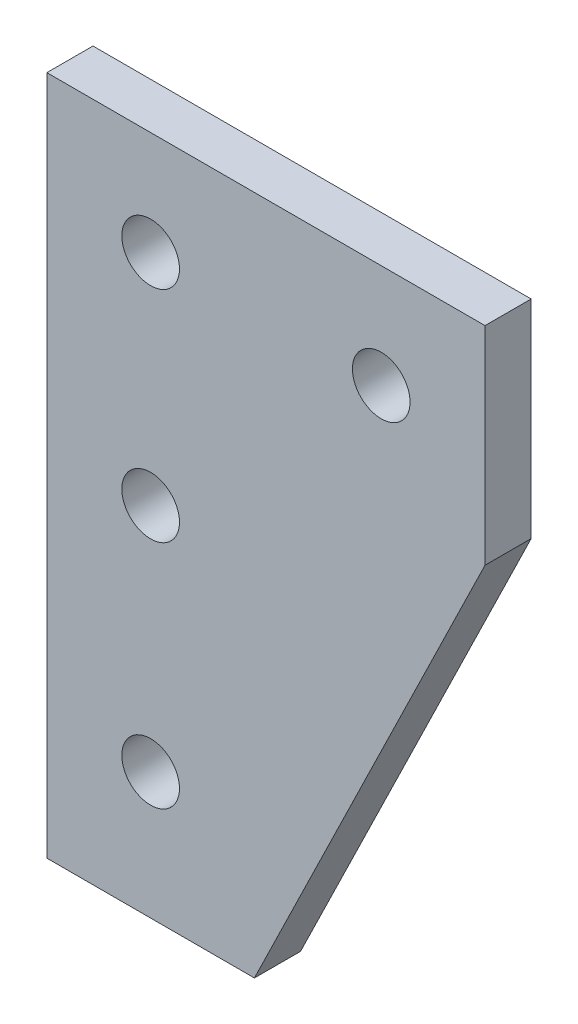
ISO-10303-21;
HEADER;
FILE_DESCRIPTION(('STEP AP214'),'2;1');
FILE_NAME('part.step','',(''),(''),'','','');
FILE_SCHEMA(('AUTOMOTIVE_DESIGN { 1 0 10303 214 1 1 1 1 }'));
ENDSEC;
DATA;
#1=APPLICATION_CONTEXT('core data for automotive mechanical design processes');
#2=APPLICATION_PROTOCOL_DEFINITION('international standard','automotive_design',2000,#1);
#3=PRODUCT_CONTEXT('',#1,'mechanical');
#4=PRODUCT('Part','Part','',(#3));
#5=PRODUCT_RELATED_PRODUCT_CATEGORY('part','',(#4));
#6=PRODUCT_DEFINITION_FORMATION('','',#4);
#7=PRODUCT_DEFINITION_CONTEXT('part definition',#1,'design');
#8=PRODUCT_DEFINITION('design','',#6,#7);
#9=PRODUCT_DEFINITION_SHAPE('','',#8);
#10=(LENGTH_UNIT() NAMED_UNIT(*) SI_UNIT(.MILLI.,.METRE.));
#11=(NAMED_UNIT(*) PLANE_ANGLE_UNIT() SI_UNIT($,.RADIAN.));
#12=(NAMED_UNIT(*) SI_UNIT($,.STERADIAN.) SOLID_ANGLE_UNIT());
#13=UNCERTAINTY_MEASURE_WITH_UNIT(LENGTH_MEASURE(1.E-05),#10,'distance_accuracy_value','');
#14=(GEOMETRIC_REPRESENTATION_CONTEXT(3) GLOBAL_UNCERTAINTY_ASSIGNED_CONTEXT((#13)) GLOBAL_UNIT_ASSIGNED_CONTEXT((#10,
#11,#12)) REPRESENTATION_CONTEXT('',''));
#15=CARTESIAN_POINT('',(0.,0.,0.));
#16=DIRECTION('',(0.,0.,1.));
#17=DIRECTION('',(1.,0.,0.));
#18=AXIS2_PLACEMENT_3D('',#15,#16,#17);
#19=CARTESIAN_POINT('',(-25.,-25.,2.));
#20=DIRECTION('',(0.,1.,0.));
#21=DIRECTION('',(0.,0.,1.));
#22=AXIS2_PLACEMENT_3D('',#19,#20,#21);
#23=PLANE('',#22);
#24=DIRECTION('',(0.,0.,1.));
#25=VECTOR('',#24,1.);
#26=CARTESIAN_POINT('',(4.5,-25.,-8.));
#27=LINE('',#26,#25);
#28=CARTESIAN_POINT('',(4.5,-25.,0.));
#29=VERTEX_POINT('',#28);
#30=CARTESIAN_POINT('',(4.5,-25.,2.));
#31=VERTEX_POINT('',#30);
#32=EDGE_CURVE('E90',#29,#31,#27,.T.);
#33=ORIENTED_EDGE('',*,*,#32,.T.);
#34=DIRECTION('',(1.,0.,0.));
#35=VECTOR('',#34,1.);
#36=CARTESIAN_POINT('',(-25.,-25.,2.));
#37=LINE('',#36,#35);
#38=CARTESIAN_POINT('',(-4.5,-25.,2.));
#39=VERTEX_POINT('',#38);
#40=EDGE_CURVE('E96',#39,#31,#37,.T.);
#41=ORIENTED_EDGE('',*,*,#40,.F.);
#42=DIRECTION('',(0.,0.,1.));
#43=VECTOR('',#42,1.);
#44=CARTESIAN_POINT('',(-4.5,-25.,-8.));
#45=LINE('',#44,#43);
#46=CARTESIAN_POINT('',(-4.5,-25.,0.));
#47=VERTEX_POINT('',#46);
#48=EDGE_CURVE('E79',#47,#39,#45,.T.);
#49=ORIENTED_EDGE('',*,*,#48,.F.);
#50=DIRECTION('',(1.,0.,0.));
#51=VECTOR('',#50,1.);
#52=CARTESIAN_POINT('',(-25.,-25.,0.));
#53=LINE('',#52,#51);
#54=EDGE_CURVE('E103',#47,#29,#53,.T.);
#55=ORIENTED_EDGE('',*,*,#54,.T.);
#56=EDGE_LOOP('',(#33,#41,#49,#55));
#57=FACE_BOUND('',#56,.T.);
#58=ADVANCED_FACE('F35',(#57),#23,.F.);
#59=CARTESIAN_POINT('',(0.,0.,2.));
#60=DIRECTION('',(0.,0.,1.));
#61=DIRECTION('',(1.,0.,0.));
#62=AXIS2_PLACEMENT_3D('',#59,#60,#61);
#63=PLANE('',#62);
#64=CARTESIAN_POINT('',(0.,0.,2.));
#65=DIRECTION('',(0.,0.,1.));
#66=DIRECTION('',(1.,0.,0.));
#67=AXIS2_PLACEMENT_3D('',#64,#65,#66);
#68=CIRCLE('',#67,1.24999999999999);
#69=CARTESIAN_POINT('',(1.24999999999999,0.,2.));
#70=VERTEX_POINT('',#69);
#71=EDGE_CURVE('E149',#70,#70,#68,.T.);
#72=ORIENTED_EDGE('',*,*,#71,.F.);
#73=EDGE_LOOP('',(#72));
#74=FACE_BOUND('',#73,.T.);
#75=CARTESIAN_POINT('',(10.,0.,2.));
#76=DIRECTION('',(0.,0.,1.));
#77=DIRECTION('',(1.,0.,0.));
#78=AXIS2_PLACEMENT_3D('',#75,#76,#77);
#79=CIRCLE('',#78,1.24999999999999);
#80=CARTESIAN_POINT('',(11.25,0.,2.));
#81=VERTEX_POINT('',#80);
#82=EDGE_CURVE('E143',#81,#81,#79,.T.);
#83=ORIENTED_EDGE('',*,*,#82,.F.);
#84=EDGE_LOOP('',(#83));
#85=FACE_BOUND('',#84,.T.);
#86=CARTESIAN_POINT('',(0.,-9.51,2.));
#87=DIRECTION('',(0.,0.,1.));
#88=DIRECTION('',(1.,0.,0.));
#89=AXIS2_PLACEMENT_3D('',#86,#87,#88);
#90=CIRCLE('',#89,1.24999999999999);
#91=CARTESIAN_POINT('',(1.24999999999999,-9.51,2.));
#92=VERTEX_POINT('',#91);
#93=EDGE_CURVE('E137',#92,#92,#90,.T.);
#94=ORIENTED_EDGE('',*,*,#93,.F.);
#95=EDGE_LOOP('',(#94));
#96=FACE_BOUND('',#95,.T.);
#97=CARTESIAN_POINT('',(0.,-19.51,2.));
#98=DIRECTION('',(0.,0.,1.));
#99=DIRECTION('',(1.,0.,0.));
#100=AXIS2_PLACEMENT_3D('',#97,#98,#99);
#101=CIRCLE('',#100,1.24999999999999);
#102=CARTESIAN_POINT('',(1.24999999999999,-19.51,2.));
#103=VERTEX_POINT('',#102);
#104=EDGE_CURVE('E134',#103,#103,#101,.T.);
#105=ORIENTED_EDGE('',*,*,#104,.F.);
#106=EDGE_LOOP('',(#105));
#107=FACE_BOUND('',#106,.T.);
#108=ORIENTED_EDGE('',*,*,#40,.T.);
#109=DIRECTION('',(0.438423632021414,0.8987684456439,0.));
#110=VECTOR('',#109,1.);
#111=CARTESIAN_POINT('',(14.5,-4.5,2.));
#112=LINE('',#111,#110);
#113=CARTESIAN_POINT('',(14.5,-4.5,2.));
#114=VERTEX_POINT('',#113);
#115=EDGE_CURVE('E100',#31,#114,#112,.T.);
#116=ORIENTED_EDGE('',*,*,#115,.T.);
#117=DIRECTION('',(0.,1.,0.));
#118=VECTOR('',#117,1.);
#119=CARTESIAN_POINT('',(14.5,4.5,2.));
#120=LINE('',#119,#118);
#121=CARTESIAN_POINT('',(14.5,4.5,2.));
#122=VERTEX_POINT('',#121);
#123=EDGE_CURVE('E123',#114,#122,#120,.T.);
#124=ORIENTED_EDGE('',*,*,#123,.T.);
#125=DIRECTION('',(-1.,0.,0.));
#126=VECTOR('',#125,1.);
#127=CARTESIAN_POINT('',(-4.5,4.5,2.));
#128=LINE('',#127,#126);
#129=CARTESIAN_POINT('',(-4.5,4.5,2.));
#130=VERTEX_POINT('',#129);
#131=EDGE_CURVE('E99',#122,#130,#128,.T.);
#132=ORIENTED_EDGE('',*,*,#131,.T.);
#133=DIRECTION('',(0.,-1.,0.));
#134=VECTOR('',#133,1.);
#135=CARTESIAN_POINT('',(-4.5,4.5,2.));
#136=LINE('',#135,#134);
#137=EDGE_CURVE('E82',#130,#39,#136,.T.);
#138=ORIENTED_EDGE('',*,*,#137,.T.);
#139=EDGE_LOOP('',(#108,#116,#124,#132,#138));
#140=FACE_BOUND('',#139,.T.);
#141=ADVANCED_FACE('F94',(#74,#85,#96,#107,#140),#63,.T.);
#142=CARTESIAN_POINT('',(0.,0.,0.));
#143=DIRECTION('',(0.,0.,1.));
#144=DIRECTION('',(1.,0.,0.));
#145=AXIS2_PLACEMENT_3D('',#142,#143,#144);
#146=PLANE('',#145);
#147=CARTESIAN_POINT('',(0.,0.,0.));
#148=DIRECTION('',(0.,0.,1.));
#149=DIRECTION('',(1.,0.,0.));
#150=AXIS2_PLACEMENT_3D('',#147,#148,#149);
#151=CIRCLE('',#150,1.24999999999999);
#152=CARTESIAN_POINT('',(1.24999999999999,0.,0.));
#153=VERTEX_POINT('',#152);
#154=EDGE_CURVE('E146',#153,#153,#151,.T.);
#155=ORIENTED_EDGE('',*,*,#154,.T.);
#156=EDGE_LOOP('',(#155));
#157=FACE_BOUND('',#156,.T.);
#158=CARTESIAN_POINT('',(10.,0.,0.));
#159=DIRECTION('',(0.,0.,1.));
#160=DIRECTION('',(1.,0.,0.));
#161=AXIS2_PLACEMENT_3D('',#158,#159,#160);
#162=CIRCLE('',#161,1.24999999999999);
#163=CARTESIAN_POINT('',(11.25,0.,0.));
#164=VERTEX_POINT('',#163);
#165=EDGE_CURVE('E140',#164,#164,#162,.T.);
#166=ORIENTED_EDGE('',*,*,#165,.T.);
#167=EDGE_LOOP('',(#166));
#168=FACE_BOUND('',#167,.T.);
#169=CARTESIAN_POINT('',(0.,-9.51,0.));
#170=DIRECTION('',(0.,0.,1.));
#171=DIRECTION('',(1.,0.,0.));
#172=AXIS2_PLACEMENT_3D('',#169,#170,#171);
#173=CIRCLE('',#172,1.24999999999999);
#174=CARTESIAN_POINT('',(1.24999999999999,-9.51,0.));
#175=VERTEX_POINT('',#174);
#176=EDGE_CURVE('E38',#175,#175,#173,.T.);
#177=ORIENTED_EDGE('',*,*,#176,.T.);
#178=EDGE_LOOP('',(#177));
#179=FACE_BOUND('',#178,.T.);
#180=CARTESIAN_POINT('',(0.,-19.51,0.));
#181=DIRECTION('',(0.,0.,1.));
#182=DIRECTION('',(1.,0.,0.));
#183=AXIS2_PLACEMENT_3D('',#180,#181,#182);
#184=CIRCLE('',#183,1.24999999999999);
#185=CARTESIAN_POINT('',(1.24999999999999,-19.51,0.));
#186=VERTEX_POINT('',#185);
#187=EDGE_CURVE('E131',#186,#186,#184,.T.);
#188=ORIENTED_EDGE('',*,*,#187,.T.);
#189=EDGE_LOOP('',(#188));
#190=FACE_BOUND('',#189,.T.);
#191=DIRECTION('',(0.438423632021414,0.8987684456439,0.));
#192=VECTOR('',#191,1.);
#193=CARTESIAN_POINT('',(13.4860643921192,-6.57856799615569,0.));
#194=LINE('',#193,#192);
#195=CARTESIAN_POINT('',(14.5,-4.5,0.));
#196=VERTEX_POINT('',#195);
#197=EDGE_CURVE('E11',#29,#196,#194,.T.);
#198=ORIENTED_EDGE('',*,*,#197,.F.);
#199=ORIENTED_EDGE('',*,*,#54,.F.);
#200=DIRECTION('',(0.,-1.,0.));
#201=VECTOR('',#200,1.);
#202=CARTESIAN_POINT('',(-4.5,0.,0.));
#203=LINE('',#202,#201);
#204=CARTESIAN_POINT('',(-4.5,4.5,0.));
#205=VERTEX_POINT('',#204);
#206=EDGE_CURVE('E85',#205,#47,#203,.T.);
#207=ORIENTED_EDGE('',*,*,#206,.F.);
#208=DIRECTION('',(-1.,0.,0.));
#209=VECTOR('',#208,1.);
#210=CARTESIAN_POINT('',(0.,4.5,0.));
#211=LINE('',#210,#209);
#212=CARTESIAN_POINT('',(14.5,4.5,0.));
#213=VERTEX_POINT('',#212);
#214=EDGE_CURVE('E105',#213,#205,#211,.T.);
#215=ORIENTED_EDGE('',*,*,#214,.F.);
#216=DIRECTION('',(0.,1.,0.));
#217=VECTOR('',#216,1.);
#218=CARTESIAN_POINT('',(14.5,0.,0.));
#219=LINE('',#218,#217);
#220=EDGE_CURVE('E43',#196,#213,#219,.T.);
#221=ORIENTED_EDGE('',*,*,#220,.F.);
#222=EDGE_LOOP('',(#198,#199,#207,#215,#221));
#223=FACE_BOUND('',#222,.T.);
#224=ADVANCED_FACE('F117',(#157,#168,#179,#190,#223),#146,.F.);
#225=CARTESIAN_POINT('',(-4.5,4.5,-8.));
#226=DIRECTION('',(0.,1.,0.));
#227=DIRECTION('',(0.,0.,1.));
#228=AXIS2_PLACEMENT_3D('',#225,#226,#227);
#229=PLANE('',#228);
#230=ORIENTED_EDGE('',*,*,#214,.T.);
#231=DIRECTION('',(0.,0.,1.));
#232=VECTOR('',#231,1.);
#233=CARTESIAN_POINT('',(-4.5,4.5,-8.));
#234=LINE('',#233,#232);
#235=EDGE_CURVE('E50',#205,#130,#234,.T.);
#236=ORIENTED_EDGE('',*,*,#235,.T.);
#237=ORIENTED_EDGE('',*,*,#131,.F.);
#238=DIRECTION('',(0.,0.,1.));
#239=VECTOR('',#238,1.);
#240=CARTESIAN_POINT('',(14.5,4.5,-8.));
#241=LINE('',#240,#239);
#242=EDGE_CURVE('E107',#213,#122,#241,.T.);
#243=ORIENTED_EDGE('',*,*,#242,.F.);
#244=EDGE_LOOP('',(#230,#236,#237,#243));
#245=FACE_BOUND('',#244,.T.);
#246=ADVANCED_FACE('F114',(#245),#229,.T.);
#247=CARTESIAN_POINT('',(14.5,4.5,-8.));
#248=DIRECTION('',(1.,0.,0.));
#249=DIRECTION('',(0.,0.,-1.));
#250=AXIS2_PLACEMENT_3D('',#247,#248,#249);
#251=PLANE('',#250);
#252=ORIENTED_EDGE('',*,*,#220,.T.);
#253=ORIENTED_EDGE('',*,*,#242,.T.);
#254=ORIENTED_EDGE('',*,*,#123,.F.);
#255=DIRECTION('',(0.,0.,1.));
#256=VECTOR('',#255,1.);
#257=CARTESIAN_POINT('',(14.5,-4.5,-8.));
#258=LINE('',#257,#256);
#259=EDGE_CURVE('E120',#196,#114,#258,.T.);
#260=ORIENTED_EDGE('',*,*,#259,.F.);
#261=EDGE_LOOP('',(#252,#253,#254,#260));
#262=FACE_BOUND('',#261,.T.);
#263=ADVANCED_FACE('F122',(#262),#251,.T.);
#264=CARTESIAN_POINT('',(14.5,-4.5,-8.));
#265=DIRECTION('',(0.8987684456439,-0.438423632021414,0.));
#266=DIRECTION('',(0.438423632021414,0.8987684456439,0.));
#267=AXIS2_PLACEMENT_3D('',#264,#265,#266);
#268=PLANE('',#267);
#269=ORIENTED_EDGE('',*,*,#197,.T.);
#270=ORIENTED_EDGE('',*,*,#259,.T.);
#271=ORIENTED_EDGE('',*,*,#115,.F.);
#272=ORIENTED_EDGE('',*,*,#32,.F.);
#273=EDGE_LOOP('',(#269,#270,#271,#272));
#274=FACE_BOUND('',#273,.T.);
#275=ADVANCED_FACE('F119',(#274),#268,.T.);
#276=CARTESIAN_POINT('',(-4.5,4.5,-8.));
#277=DIRECTION('',(-1.,0.,0.));
#278=DIRECTION('',(0.,-1.,0.));
#279=AXIS2_PLACEMENT_3D('',#276,#277,#278);
#280=PLANE('',#279);
#281=ORIENTED_EDGE('',*,*,#206,.T.);
#282=ORIENTED_EDGE('',*,*,#48,.T.);
#283=ORIENTED_EDGE('',*,*,#137,.F.);
#284=ORIENTED_EDGE('',*,*,#235,.F.);
#285=EDGE_LOOP('',(#281,#282,#283,#284));
#286=FACE_BOUND('',#285,.T.);
#287=ADVANCED_FACE('F81',(#286),#280,.T.);
#288=CARTESIAN_POINT('',(0.,-19.51,2.));
#289=DIRECTION('',(0.,0.,1.));
#290=DIRECTION('',(1.,0.,0.));
#291=AXIS2_PLACEMENT_3D('',#288,#289,#290);
#292=CYLINDRICAL_SURFACE('',#291,1.24999999999999);
#293=ORIENTED_EDGE('',*,*,#104,.T.);
#294=EDGE_LOOP('',(#293));
#295=FACE_BOUND('',#294,.T.);
#296=ORIENTED_EDGE('',*,*,#187,.F.);
#297=EDGE_LOOP('',(#296));
#298=FACE_BOUND('',#297,.T.);
#299=ADVANCED_FACE('F165',(#295,#298),#292,.F.);
#300=CARTESIAN_POINT('',(0.,-9.51,2.));
#301=DIRECTION('',(0.,0.,1.));
#302=DIRECTION('',(1.,0.,0.));
#303=AXIS2_PLACEMENT_3D('',#300,#301,#302);
#304=CYLINDRICAL_SURFACE('',#303,1.24999999999999);
#305=ORIENTED_EDGE('',*,*,#93,.T.);
#306=EDGE_LOOP('',(#305));
#307=FACE_BOUND('',#306,.T.);
#308=ORIENTED_EDGE('',*,*,#176,.F.);
#309=EDGE_LOOP('',(#308));
#310=FACE_BOUND('',#309,.T.);
#311=ADVANCED_FACE('F168',(#307,#310),#304,.F.);
#312=CARTESIAN_POINT('',(10.,0.,2.));
#313=DIRECTION('',(0.,0.,1.));
#314=DIRECTION('',(1.,0.,0.));
#315=AXIS2_PLACEMENT_3D('',#312,#313,#314);
#316=CYLINDRICAL_SURFACE('',#315,1.24999999999999);
#317=ORIENTED_EDGE('',*,*,#82,.T.);
#318=EDGE_LOOP('',(#317));
#319=FACE_BOUND('',#318,.T.);
#320=ORIENTED_EDGE('',*,*,#165,.F.);
#321=EDGE_LOOP('',(#320));
#322=FACE_BOUND('',#321,.T.);
#323=ADVANCED_FACE('F213',(#319,#322),#316,.F.);
#324=CARTESIAN_POINT('',(0.,0.,2.));
#325=DIRECTION('',(0.,0.,1.));
#326=DIRECTION('',(1.,0.,0.));
#327=AXIS2_PLACEMENT_3D('',#324,#325,#326);
#328=CYLINDRICAL_SURFACE('',#327,1.24999999999999);
#329=ORIENTED_EDGE('',*,*,#71,.T.);
#330=EDGE_LOOP('',(#329));
#331=FACE_BOUND('',#330,.T.);
#332=ORIENTED_EDGE('',*,*,#154,.F.);
#333=EDGE_LOOP('',(#332));
#334=FACE_BOUND('',#333,.T.);
#335=ADVANCED_FACE('F153',(#331,#334),#328,.F.);
#336=CLOSED_SHELL('',(#58,#141,#224,#246,#263,#275,#287,#299,#311,#323,#335));
#337=MANIFOLD_SOLID_BREP('B2',#336);
#338=ADVANCED_BREP_SHAPE_REPRESENTATION('',(#18,#337),#14);
#339=SHAPE_DEFINITION_REPRESENTATION(#9,#338);
ENDSEC;
END-ISO-10303-21;
